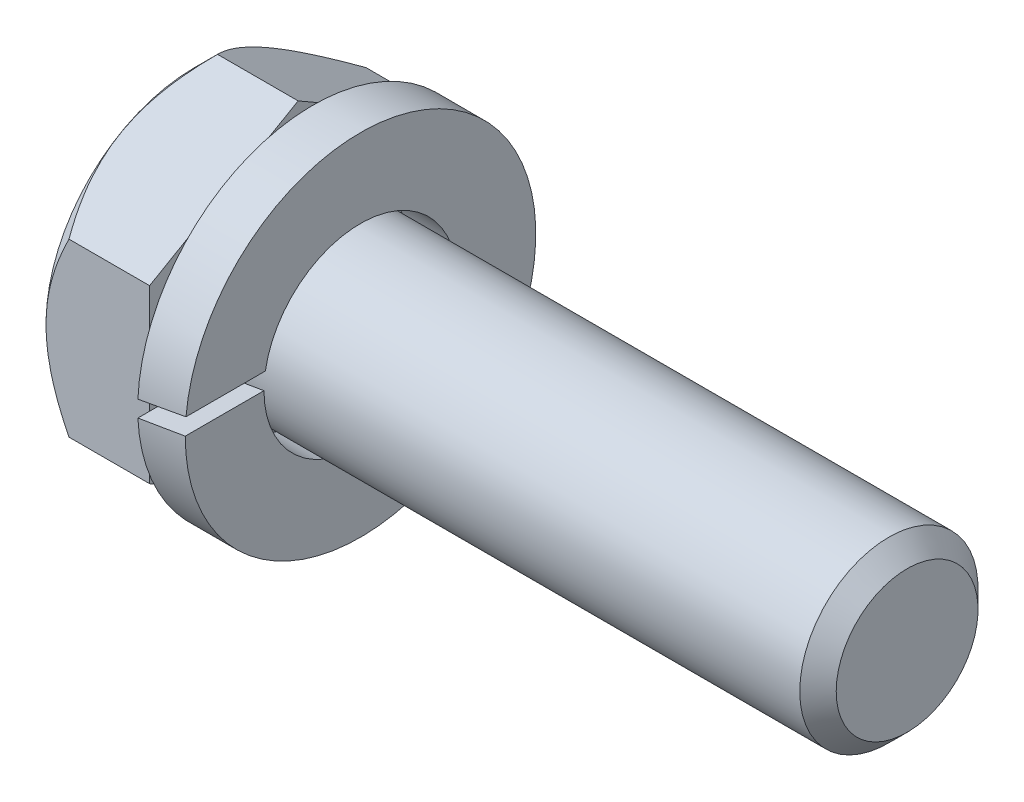
ISO-10303-21;
HEADER;
FILE_DESCRIPTION(('STEP AP214'),'2;1');
FILE_NAME('part.step','',(''),(''),'','','');
FILE_SCHEMA(('AUTOMOTIVE_DESIGN { 1 0 10303 214 1 1 1 1 }'));
ENDSEC;
DATA;
#1=APPLICATION_CONTEXT('core data for automotive mechanical design processes');
#2=APPLICATION_PROTOCOL_DEFINITION('international standard','automotive_design',2000,#1);
#3=PRODUCT_CONTEXT('',#1,'mechanical');
#4=PRODUCT('Part','Part','',(#3));
#5=PRODUCT_RELATED_PRODUCT_CATEGORY('part','',(#4));
#6=PRODUCT_DEFINITION_FORMATION('','',#4);
#7=PRODUCT_DEFINITION_CONTEXT('part definition',#1,'design');
#8=PRODUCT_DEFINITION('design','',#6,#7);
#9=PRODUCT_DEFINITION_SHAPE('','',#8);
#10=(LENGTH_UNIT() NAMED_UNIT(*) SI_UNIT(.MILLI.,.METRE.));
#11=(NAMED_UNIT(*) PLANE_ANGLE_UNIT() SI_UNIT($,.RADIAN.));
#12=(NAMED_UNIT(*) SI_UNIT($,.STERADIAN.) SOLID_ANGLE_UNIT());
#13=UNCERTAINTY_MEASURE_WITH_UNIT(LENGTH_MEASURE(1.E-05),#10,'distance_accuracy_value','');
#14=(GEOMETRIC_REPRESENTATION_CONTEXT(3) GLOBAL_UNCERTAINTY_ASSIGNED_CONTEXT((#13)) GLOBAL_UNIT_ASSIGNED_CONTEXT((#10,
#11,#12)) REPRESENTATION_CONTEXT('',''));
#15=CARTESIAN_POINT('',(0.,0.,0.));
#16=DIRECTION('',(0.,0.,1.));
#17=DIRECTION('',(1.,0.,0.));
#18=AXIS2_PLACEMENT_3D('',#15,#16,#17);
#19=CARTESIAN_POINT('',(0.,0.,0.));
#20=DIRECTION('',(1.,0.,0.));
#21=DIRECTION('',(0.,0.,-1.));
#22=AXIS2_PLACEMENT_3D('',#19,#20,#21);
#23=PLANE('',#22);
#24=CARTESIAN_POINT('',(0.,0.,0.));
#25=DIRECTION('',(1.,0.,0.));
#26=DIRECTION('',(0.,1.,0.));
#27=AXIS2_PLACEMENT_3D('',#24,#25,#26);
#28=CIRCLE('',#27,4.98782849064128);
#29=CARTESIAN_POINT('',(0.,4.98782849064128,0.));
#30=VERTEX_POINT('',#29);
#31=EDGE_CURVE('E93',#30,#30,#28,.T.);
#32=ORIENTED_EDGE('',*,*,#31,.F.);
#33=EDGE_LOOP('',(#32));
#34=FACE_BOUND('',#33,.T.);
#35=ADVANCED_FACE('F17',(#34),#23,.F.);
#36=CARTESIAN_POINT('',(0.790388246400653,0.,0.));
#37=DIRECTION('',(1.,0.,0.));
#38=DIRECTION('',(0.,1.,0.));
#39=AXIS2_PLACEMENT_3D('',#36,#37,#38);
#40=CONICAL_SURFACE('',#39,5.77821673704193,0.785398163397448);
#41=ORIENTED_EDGE('',*,*,#31,.T.);
#42=EDGE_LOOP('',(#41));
#43=FACE_BOUND('',#42,.T.);
#44=CARTESIAN_POINT('',(0.785674201271153,-5.77350269190118,-2.443489514586E-11));
#45=CARTESIAN_POINT('',(0.736048729817891,-5.72386977190017,0.0859667391553501));
#46=CARTESIAN_POINT('',(0.687946283924636,-5.67385536346438,0.172594235680909));
#47=CARTESIAN_POINT('',(0.595250703125351,-5.57298874154595,0.347300349634679));
#48=CARTESIAN_POINT('',(0.550659484629607,-5.52213608861416,0.435379728211159));
#49=CARTESIAN_POINT('',(0.422467391401462,-5.36773619419112,0.702808190033449));
#50=CARTESIAN_POINT('',(0.344994843842084,-5.2628819681038,0.884421037005834));
#51=CARTESIAN_POINT('',(0.212328879996502,-5.05143510511504,1.25065774680401));
#52=CARTESIAN_POINT('',(0.156801274711727,-4.94489649859185,1.43518802626953));
#53=CARTESIAN_POINT('',(0.0925698065095275,-4.78333727128345,1.71501681639916));
#54=CARTESIAN_POINT('',(0.0743445613691895,-4.72924636014758,1.8087050227142));
#55=CARTESIAN_POINT('',(0.0446597561360612,-4.62060660806497,1.99687459304298));
#56=CARTESIAN_POINT('',(0.0331991852174752,-4.56605783677109,2.09135583641444));
#57=CARTESIAN_POINT('',(0.0139833875195146,-4.4331252492637,2.32160183195882));
#58=CARTESIAN_POINT('',(0.00995211759112042,-4.35459819518237,2.4576146793964));
#59=CARTESIAN_POINT('',(0.0167221402267244,-4.19768567118316,2.72939514330691));
#60=CARTESIAN_POINT('',(0.027528631737059,-4.1193002605328,2.86516265712548));
#61=CARTESIAN_POINT('',(0.0633371757997653,-3.96326849991269,3.13541759411394));
#62=CARTESIAN_POINT('',(0.0883550996709724,-3.88562307510411,3.26990341485766));
#63=CARTESIAN_POINT('',(0.151226396311497,-3.73166678009449,3.53656353995939));
#64=CARTESIAN_POINT('',(0.189078784705768,-3.65535580801574,3.66873802077476));
#65=CARTESIAN_POINT('',(0.266947120415034,-3.51989944345856,3.90335532639636));
#66=CARTESIAN_POINT('',(0.304913990565411,-3.46045392818726,4.00631797912836));
#67=CARTESIAN_POINT('',(0.386965083990171,-3.34262984934184,4.21039527004364));
#68=CARTESIAN_POINT('',(0.431049491698554,-3.28425131799565,4.31150985240649));
#69=CARTESIAN_POINT('',(0.524347678410254,-3.16874509572953,4.51157249796175));
#70=CARTESIAN_POINT('',(0.5735453250176,-3.11161411994489,4.61052625070673));
#71=CARTESIAN_POINT('',(0.676424289361197,-2.99840990271166,4.80660170658575));
#72=CARTESIAN_POINT('',(0.730102859235246,-2.94233603849609,4.90372448838383));
#73=CARTESIAN_POINT('',(0.785674201267338,-2.88675134593577,5.0000000000214));
#74=B_SPLINE_CURVE_WITH_KNOTS('',3,(#44,#45,#46,#47,#48,#49,#50,#51,#52,#53,#54,#55,#56,#57,#58,
#59,#60,#61,#62,#63,#64,#65,#66,#67,#68,#69,#70,#71,#72,#73),.UNSPECIFIED.,.F.,.F.,(4,2,2,2,2,2,
2,2,2,2,2,2,2,2,4),(0.,0.332918274938574,0.66601701335916,1.33580998779217,1.99496891453922,
2.32390206369673,2.65278604886947,3.12337124426573,3.59412136828829,4.06539826228084,
4.53663901855104,4.91088168852215,5.28513564376501,5.65824273699947,6.03112268520356),.UNSPECIFIED.);
#75=CARTESIAN_POINT('',(0.785674201267662,-5.77350269190894,0.));
#76=VERTEX_POINT('',#75);
#77=CARTESIAN_POINT('',(0.785674201267662,-2.88675134595447,5.00000000001098));
#78=VERTEX_POINT('',#77);
#79=EDGE_CURVE('E71',#76,#78,#74,.T.);
#80=ORIENTED_EDGE('',*,*,#79,.T.);
#81=CARTESIAN_POINT('',(0.785674201271152,-2.88675134597175,4.99999999999204));
#82=CARTESIAN_POINT('',(0.736048729817889,-2.78748550596104,4.99999999999707));
#83=CARTESIAN_POINT('',(0.687946283924634,-2.68745668908576,4.9999999999992));
#84=CARTESIAN_POINT('',(0.59525070312535,-2.48572344524612,5.0000000000008));
#85=CARTESIAN_POINT('',(0.550659484629606,-2.38401813938345,5.00000000000028));
#86=CARTESIAN_POINT('',(0.422467391401462,-2.07521835053883,4.99999999999944));
#87=CARTESIAN_POINT('',(0.344994843842083,-1.86550989836347,4.99999999999985));
#88=CARTESIAN_POINT('',(0.212328879996501,-1.44261617238544,5.00000000000014));
#89=CARTESIAN_POINT('',(0.156801274711727,-1.22953895933927,5.00000000000003));
#90=CARTESIAN_POINT('',(0.0925698065095271,-0.906420504722544,4.99999999999999));
#91=CARTESIAN_POINT('',(0.0743445613691887,-0.79823868245078,5.));
#92=CARTESIAN_POINT('',(0.0446597561360605,-0.580959178285553,5.));
#93=CARTESIAN_POINT('',(0.0331991852174749,-0.471861635697782,5.));
#94=CARTESIAN_POINT('',(0.0139833875195144,-0.205996460683025,5.));
#95=CARTESIAN_POINT('',(0.00995211759111945,-0.0489423525203513,5.));
#96=CARTESIAN_POINT('',(0.0167221402267236,0.264882695478073,5.));
#97=CARTESIAN_POINT('',(0.0275286317370591,0.421653516778786,5.));
#98=CARTESIAN_POINT('',(0.0633371757997657,0.733717038019014,5.));
#99=CARTESIAN_POINT('',(0.0883550996709721,0.88900788763616,5.));
#100=CARTESIAN_POINT('',(0.151226396311496,1.19692047765541,5.));
#101=CARTESIAN_POINT('',(0.189078784705767,1.34954242181291,5.));
#102=CARTESIAN_POINT('',(0.266947120415033,1.62045515092726,5.));
#103=CARTESIAN_POINT('',(0.30491399056541,1.73934618146986,5.));
#104=CARTESIAN_POINT('',(0.38696508399017,1.97499433916071,5.));
#105=CARTESIAN_POINT('',(0.431049491698553,2.09175140185309,5.));
#106=CARTESIAN_POINT('',(0.524347678410253,2.32276384638533,5.));
#107=CARTESIAN_POINT('',(0.5735453250176,2.43702579795461,5.));
#108=CARTESIAN_POINT('',(0.676424289361197,2.66343423242106,5.));
#109=CARTESIAN_POINT('',(0.730102859235247,2.7755819608522,5.));
#110=CARTESIAN_POINT('',(0.785674201267337,2.88675134597284,5.));
#111=B_SPLINE_CURVE_WITH_KNOTS('',3,(#81,#82,#83,#84,#85,#86,#87,#88,#89,#90,#91,#92,#93,#94,
#95,#96,#97,#98,#99,#100,#101,#102,#103,#104,#105,#106,#107,#108,#109,#110),.UNSPECIFIED.,.F.,
.F.,(4,2,2,2,2,2,2,2,2,2,2,2,2,2,4),(0.,0.332918274938574,0.666017013359159,1.33580998779217,
1.99496891453922,2.32390206369673,2.65278604886946,3.12337124426573,3.59412136828829,
4.06539826228084,4.53663901855104,4.91088168852215,5.28513564376501,5.65824273699947,
6.03112268520356),.UNSPECIFIED.);
#112=CARTESIAN_POINT('',(0.785674201261322,2.88675134596081,5.));
#113=VERTEX_POINT('',#112);
#114=EDGE_CURVE('E74',#78,#113,#111,.T.);
#115=ORIENTED_EDGE('',*,*,#114,.T.);
#116=CARTESIAN_POINT('',(0.785674201271154,2.88675134592943,5.00000000001647));
#117=CARTESIAN_POINT('',(0.736048729817892,2.93638426593913,4.91403326084171));
#118=CARTESIAN_POINT('',(0.687946283924637,2.98639867437862,4.82740576431829));
#119=CARTESIAN_POINT('',(0.595250703125352,3.08726529629983,4.65269965036612));
#120=CARTESIAN_POINT('',(0.550659484629608,3.13811794923071,4.56462027178912));
#121=CARTESIAN_POINT('',(0.422467391401464,3.29251784365229,4.29719180996599));
#122=CARTESIAN_POINT('',(0.344994843842086,3.39737206974033,4.11557896299402));
#123=CARTESIAN_POINT('',(0.212328879996504,3.6088189327296,3.74934225319613));
#124=CARTESIAN_POINT('',(0.156801274711729,3.71535753925258,3.5648119737305));
#125=CARTESIAN_POINT('',(0.0925698065095297,3.87691676656091,3.28498318360083));
#126=CARTESIAN_POINT('',(0.0743445613691918,3.9310076776968,3.1912949772858));
#127=CARTESIAN_POINT('',(0.0446597561360633,4.03964742977942,3.00312540695703));
#128=CARTESIAN_POINT('',(0.033199185217477,4.0941962010733,2.90864416358556));
#129=CARTESIAN_POINT('',(0.013983387519516,4.22712878858068,2.67839816804118));
#130=CARTESIAN_POINT('',(0.00995211759112181,4.30565584266202,2.5423853206036));
#131=CARTESIAN_POINT('',(0.0167221402267265,4.46256836666123,2.27060485669309));
#132=CARTESIAN_POINT('',(0.0275286317370619,4.54095377731159,2.13483734287452));
#133=CARTESIAN_POINT('',(0.0633371757997677,4.6969855379317,1.86458240588606));
#134=CARTESIAN_POINT('',(0.0883550996709736,4.77463096274028,1.73009658514234));
#135=CARTESIAN_POINT('',(0.151226396311497,4.9285872577499,1.46343646004061));
#136=CARTESIAN_POINT('',(0.189078784705769,5.00489822982865,1.33126197922524));
#137=CARTESIAN_POINT('',(0.266947120415035,5.14035459438583,1.09664467360365));
#138=CARTESIAN_POINT('',(0.304913990565411,5.19980010965712,0.993682020871646));
#139=CARTESIAN_POINT('',(0.386965083990172,5.31762418850255,0.789604729956367));
#140=CARTESIAN_POINT('',(0.431049491698554,5.37600271984874,0.688490147593513));
#141=CARTESIAN_POINT('',(0.524347678410254,5.49150894211486,0.488427502038256));
#142=CARTESIAN_POINT('',(0.573545325017601,5.5486399178995,0.389473749293271));
#143=CARTESIAN_POINT('',(0.676424289361197,5.66184413513272,0.193398293414257));
#144=CARTESIAN_POINT('',(0.730102859235247,5.71791799934829,0.0962755116161708));
#145=CARTESIAN_POINT('',(0.785674201267338,5.77350269190862,-2.14011097428065E-11));
#146=B_SPLINE_CURVE_WITH_KNOTS('',3,(#116,#117,#118,#119,#120,#121,#122,#123,#124,#125,#126,
#127,#128,#129,#130,#131,#132,#133,#134,#135,#136,#137,#138,#139,#140,#141,#142,#143,#144,#145),
.UNSPECIFIED.,.F.,.F.,(4,2,2,2,2,2,2,2,2,2,2,2,2,2,4),(0.,0.332918274938573,0.666017013359158,
1.33580998779216,1.99496891453921,2.32390206369672,2.65278604886946,3.12337124426573,
3.59412136828829,4.06539826228083,4.53663901855103,4.91088168852215,5.28513564376501,
5.65824273699947,6.03112268520355),.UNSPECIFIED.);
#147=CARTESIAN_POINT('',(0.785674201267662,5.77350269190894,0.));
#148=VERTEX_POINT('',#147);
#149=EDGE_CURVE('E179',#113,#148,#146,.T.);
#150=ORIENTED_EDGE('',*,*,#149,.T.);
#151=CARTESIAN_POINT('',(0.785674201271152,5.77350269190117,2.44325864307196E-11));
#152=CARTESIAN_POINT('',(0.73604872981789,5.72386977190017,-0.0859667391553527));
#153=CARTESIAN_POINT('',(0.687946283924635,5.67385536346438,-0.172594235680911));
#154=CARTESIAN_POINT('',(0.59525070312535,5.57298874154595,-0.347300349634682));
#155=CARTESIAN_POINT('',(0.550659484629606,5.52213608861416,-0.435379728211161));
#156=CARTESIAN_POINT('',(0.422467391401461,5.36773619419112,-0.702808190033451));
#157=CARTESIAN_POINT('',(0.344994843842083,5.2628819681038,-0.884421037005836));
#158=CARTESIAN_POINT('',(0.212328879996502,5.05143510511504,-1.25065774680401));
#159=CARTESIAN_POINT('',(0.156801274711727,4.94489649859185,-1.43518802626953));
#160=CARTESIAN_POINT('',(0.0925698065095274,4.78333727128345,-1.71501681639916));
#161=CARTESIAN_POINT('',(0.074344561369189,4.72924636014758,-1.8087050227142));
#162=CARTESIAN_POINT('',(0.0446597561360606,4.62060660806497,-1.99687459304298));
#163=CARTESIAN_POINT('',(0.033199185217475,4.56605783677109,-2.09135583641444));
#164=CARTESIAN_POINT('',(0.0139833875195149,4.4331252492637,-2.32160183195882));
#165=CARTESIAN_POINT('',(0.00995211759112049,4.35459819518237,-2.4576146793964));
#166=CARTESIAN_POINT('',(0.0167221402267244,4.19768567118316,-2.72939514330691));
#167=CARTESIAN_POINT('',(0.0275286317370591,4.1193002605328,-2.86516265712548));
#168=CARTESIAN_POINT('',(0.0633371757997653,3.96326849991269,-3.13541759411394));
#169=CARTESIAN_POINT('',(0.0883550996709722,3.88562307510411,-3.26990341485766));
#170=CARTESIAN_POINT('',(0.151226396311497,3.73166678009449,-3.53656353995939));
#171=CARTESIAN_POINT('',(0.189078784705768,3.65535580801574,-3.66873802077476));
#172=CARTESIAN_POINT('',(0.266947120415034,3.51989944345856,-3.90335532639636));
#173=CARTESIAN_POINT('',(0.30491399056541,3.46045392818726,-4.00631797912836));
#174=CARTESIAN_POINT('',(0.38696508399017,3.34262984934184,-4.21039527004364));
#175=CARTESIAN_POINT('',(0.431049491698553,3.28425131799565,-4.31150985240649));
#176=CARTESIAN_POINT('',(0.524347678410254,3.16874509572953,-4.51157249796175));
#177=CARTESIAN_POINT('',(0.5735453250176,3.11161411994489,-4.61052625070673));
#178=CARTESIAN_POINT('',(0.676424289361198,2.99840990271166,-4.80660170658575));
#179=CARTESIAN_POINT('',(0.730102859235247,2.94233603849609,-4.90372448838383));
#180=CARTESIAN_POINT('',(0.785674201267338,2.88675134593577,-5.0000000000214));
#181=B_SPLINE_CURVE_WITH_KNOTS('',3,(#151,#152,#153,#154,#155,#156,#157,#158,#159,#160,#161,
#162,#163,#164,#165,#166,#167,#168,#169,#170,#171,#172,#173,#174,#175,#176,#177,#178,#179,#180),
.UNSPECIFIED.,.F.,.F.,(4,2,2,2,2,2,2,2,2,2,2,2,2,2,4),(0.,0.332918274938574,0.666017013359159,
1.33580998779217,1.99496891453922,2.32390206369673,2.65278604886946,3.12337124426573,
3.59412136828829,4.06539826228083,4.53663901855103,4.91088168852215,5.28513564376501,
5.65824273699947,6.03112268520356),.UNSPECIFIED.);
#182=CARTESIAN_POINT('',(0.785674201267662,2.88675134595447,-5.00000000001098));
#183=VERTEX_POINT('',#182);
#184=EDGE_CURVE('E186',#148,#183,#181,.T.);
#185=ORIENTED_EDGE('',*,*,#184,.T.);
#186=CARTESIAN_POINT('',(0.785674201271152,2.88675134597175,-4.99999999999204));
#187=CARTESIAN_POINT('',(0.736048729817889,2.78748550596104,-4.99999999999707));
#188=CARTESIAN_POINT('',(0.687946283924634,2.68745668908576,-4.9999999999992));
#189=CARTESIAN_POINT('',(0.595250703125349,2.48572344524612,-5.0000000000008));
#190=CARTESIAN_POINT('',(0.550659484629606,2.38401813938345,-5.00000000000028));
#191=CARTESIAN_POINT('',(0.422467391401462,2.07521835053883,-4.99999999999944));
#192=CARTESIAN_POINT('',(0.344994843842084,1.86550989836347,-4.99999999999985));
#193=CARTESIAN_POINT('',(0.212328879996502,1.44261617238544,-5.00000000000014));
#194=CARTESIAN_POINT('',(0.156801274711727,1.22953895933927,-5.00000000000003));
#195=CARTESIAN_POINT('',(0.092569806509527,0.906420504722544,-4.99999999999999));
#196=CARTESIAN_POINT('',(0.0743445613691887,0.79823868245078,-5.));
#197=CARTESIAN_POINT('',(0.0446597561360605,0.580959178285553,-5.));
#198=CARTESIAN_POINT('',(0.0331991852174749,0.471861635697781,-5.));
#199=CARTESIAN_POINT('',(0.0139833875195143,0.205996460683024,-5.));
#200=CARTESIAN_POINT('',(0.0099521175911194,0.0489423525203509,-5.));
#201=CARTESIAN_POINT('',(0.0167221402267236,-0.264882695478073,-5.));
#202=CARTESIAN_POINT('',(0.0275286317370591,-0.421653516778786,-5.));
#203=CARTESIAN_POINT('',(0.0633371757997658,-0.733717038019015,-5.));
#204=CARTESIAN_POINT('',(0.0883550996709721,-0.88900788763616,-5.));
#205=CARTESIAN_POINT('',(0.151226396311496,-1.19692047765541,-5.));
#206=CARTESIAN_POINT('',(0.189078784705767,-1.34954242181291,-5.));
#207=CARTESIAN_POINT('',(0.266947120415032,-1.62045515092726,-5.));
#208=CARTESIAN_POINT('',(0.304913990565409,-1.73934618146986,-5.));
#209=CARTESIAN_POINT('',(0.386965083990169,-1.97499433916071,-5.));
#210=CARTESIAN_POINT('',(0.431049491698552,-2.09175140185309,-5.));
#211=CARTESIAN_POINT('',(0.524347678410252,-2.32276384638532,-5.));
#212=CARTESIAN_POINT('',(0.573545325017599,-2.4370257979546,-5.));
#213=CARTESIAN_POINT('',(0.676424289361195,-2.66343423242106,-5.));
#214=CARTESIAN_POINT('',(0.730102859235245,-2.7755819608522,-5.));
#215=CARTESIAN_POINT('',(0.785674201267335,-2.88675134597284,-5.));
#216=B_SPLINE_CURVE_WITH_KNOTS('',3,(#186,#187,#188,#189,#190,#191,#192,#193,#194,#195,#196,
#197,#198,#199,#200,#201,#202,#203,#204,#205,#206,#207,#208,#209,#210,#211,#212,#213,#214,#215),
.UNSPECIFIED.,.F.,.F.,(4,2,2,2,2,2,2,2,2,2,2,2,2,2,4),(0.,0.332918274938574,0.666017013359159,
1.33580998779217,1.99496891453922,2.32390206369673,2.65278604886946,3.12337124426573,
3.59412136828829,4.06539826228084,4.53663901855104,4.91088168852215,5.28513564376501,
5.65824273699947,6.03112268520355),.UNSPECIFIED.);
#217=CARTESIAN_POINT('',(0.785674201267662,-2.88675134595447,-5.00000000001098));
#218=VERTEX_POINT('',#217);
#219=EDGE_CURVE('E211',#183,#218,#216,.T.);
#220=ORIENTED_EDGE('',*,*,#219,.T.);
#221=CARTESIAN_POINT('',(0.785674201271157,-2.88675134592943,-5.00000000001647));
#222=CARTESIAN_POINT('',(0.736048729817893,-2.93638426593913,-4.91403326084172));
#223=CARTESIAN_POINT('',(0.687946283924638,-2.98639867437862,-4.82740576431829));
#224=CARTESIAN_POINT('',(0.595250703125353,-3.08726529629983,-4.65269965036612));
#225=CARTESIAN_POINT('',(0.550659484629609,-3.13811794923071,-4.56462027178912));
#226=CARTESIAN_POINT('',(0.422467391401465,-3.29251784365229,-4.29719180996599));
#227=CARTESIAN_POINT('',(0.344994843842086,-3.39737206974033,-4.11557896299402));
#228=CARTESIAN_POINT('',(0.212328879996504,-3.6088189327296,-3.74934225319613));
#229=CARTESIAN_POINT('',(0.156801274711729,-3.71535753925259,-3.5648119737305));
#230=CARTESIAN_POINT('',(0.0925698065095292,-3.87691676656091,-3.28498318360083));
#231=CARTESIAN_POINT('',(0.0743445613691911,-3.9310076776968,-3.1912949772858));
#232=CARTESIAN_POINT('',(0.0446597561360628,-4.03964742977942,-3.00312540695702));
#233=CARTESIAN_POINT('',(0.033199185217477,-4.0941962010733,-2.90864416358556));
#234=CARTESIAN_POINT('',(0.0139833875195165,-4.22712878858068,-2.67839816804118));
#235=CARTESIAN_POINT('',(0.00995211759112203,-4.30565584266202,-2.5423853206036));
#236=CARTESIAN_POINT('',(0.0167221402267262,-4.46256836666123,-2.27060485669309));
#237=CARTESIAN_POINT('',(0.0275286317370612,-4.54095377731159,-2.13483734287452));
#238=CARTESIAN_POINT('',(0.0633371757997674,-4.6969855379317,-1.86458240588606));
#239=CARTESIAN_POINT('',(0.0883550996709739,-4.77463096274028,-1.73009658514234));
#240=CARTESIAN_POINT('',(0.151226396311498,-4.9285872577499,-1.46343646004061));
#241=CARTESIAN_POINT('',(0.18907878470577,-5.00489822982865,-1.33126197922524));
#242=CARTESIAN_POINT('',(0.266947120415035,-5.14035459438583,-1.09664467360364));
#243=CARTESIAN_POINT('',(0.304913990565411,-5.19980010965713,-0.993682020871644));
#244=CARTESIAN_POINT('',(0.386965083990172,-5.31762418850255,-0.789604729956365));
#245=CARTESIAN_POINT('',(0.431049491698555,-5.37600271984874,-0.688490147593512));
#246=CARTESIAN_POINT('',(0.524347678410255,-5.49150894211486,-0.488427502038256));
#247=CARTESIAN_POINT('',(0.573545325017601,-5.5486399178995,-0.389473749293271));
#248=CARTESIAN_POINT('',(0.676424289361197,-5.66184413513272,-0.193398293414258));
#249=CARTESIAN_POINT('',(0.730102859235247,-5.71791799934829,-0.0962755116161715));
#250=CARTESIAN_POINT('',(0.785674201267338,-5.77350269190862,2.13997418227646E-11));
#251=B_SPLINE_CURVE_WITH_KNOTS('',3,(#221,#222,#223,#224,#225,#226,#227,#228,#229,#230,#231,
#232,#233,#234,#235,#236,#237,#238,#239,#240,#241,#242,#243,#244,#245,#246,#247,#248,#249,#250),
.UNSPECIFIED.,.F.,.F.,(4,2,2,2,2,2,2,2,2,2,2,2,2,2,4),(0.,0.332918274938574,0.66601701335916,
1.33580998779217,1.99496891453922,2.32390206369673,2.65278604886946,3.12337124426573,
3.59412136828829,4.06539826228084,4.53663901855104,4.91088168852215,5.28513564376501,
5.65824273699947,6.03112268520356),.UNSPECIFIED.);
#252=EDGE_CURVE('E77',#218,#76,#251,.T.);
#253=ORIENTED_EDGE('',*,*,#252,.T.);
#254=EDGE_LOOP('',(#80,#115,#150,#185,#220,#253));
#255=FACE_BOUND('',#254,.T.);
#256=ADVANCED_FACE('F73',(#43,#255),#40,.T.);
#257=CARTESIAN_POINT('',(3.5,2.88675134594813,5.));
#258=DIRECTION('',(0.,0.,-1.));
#259=DIRECTION('',(-1.,0.,0.));
#260=AXIS2_PLACEMENT_3D('',#257,#258,#259);
#261=PLANE('',#260);
#262=ORIENTED_EDGE('',*,*,#114,.F.);
#263=DIRECTION('',(1.,0.,0.));
#264=VECTOR('',#263,1.);
#265=CARTESIAN_POINT('',(3.5,-2.88675134594813,5.));
#266=LINE('',#265,#264);
#267=CARTESIAN_POINT('',(3.5,-2.88675134594813,5.));
#268=VERTEX_POINT('',#267);
#269=EDGE_CURVE('E82',#78,#268,#266,.T.);
#270=ORIENTED_EDGE('',*,*,#269,.T.);
#271=DIRECTION('',(0.,1.,0.));
#272=VECTOR('',#271,1.);
#273=CARTESIAN_POINT('',(3.5,0.,5.));
#274=LINE('',#273,#272);
#275=CARTESIAN_POINT('',(3.5,2.88675134594813,5.));
#276=VERTEX_POINT('',#275);
#277=EDGE_CURVE('E120',#276,#268,#274,.F.);
#278=ORIENTED_EDGE('',*,*,#277,.F.);
#279=DIRECTION('',(1.,0.,0.));
#280=VECTOR('',#279,1.);
#281=CARTESIAN_POINT('',(3.5,2.88675134594813,5.));
#282=LINE('',#281,#280);
#283=EDGE_CURVE('E91',#276,#113,#282,.F.);
#284=ORIENTED_EDGE('',*,*,#283,.T.);
#285=EDGE_LOOP('',(#262,#270,#278,#284));
#286=FACE_BOUND('',#285,.T.);
#287=ADVANCED_FACE('F86',(#286),#261,.F.);
#288=CARTESIAN_POINT('',(3.5,-2.88675134594813,5.));
#289=DIRECTION('',(0.,0.866025403784439,-0.5));
#290=DIRECTION('',(0.,0.5,0.866025403784439));
#291=AXIS2_PLACEMENT_3D('',#288,#289,#290);
#292=PLANE('',#291);
#293=ORIENTED_EDGE('',*,*,#79,.F.);
#294=DIRECTION('',(1.,0.,0.));
#295=VECTOR('',#294,1.);
#296=CARTESIAN_POINT('',(3.5,-5.77350269189626,0.));
#297=LINE('',#296,#295);
#298=CARTESIAN_POINT('',(3.5,-5.77350269189626,0.));
#299=VERTEX_POINT('',#298);
#300=EDGE_CURVE('E100',#76,#299,#297,.T.);
#301=ORIENTED_EDGE('',*,*,#300,.T.);
#302=DIRECTION('',(0.,-0.5,-0.866025403784439));
#303=VECTOR('',#302,1.);
#304=CARTESIAN_POINT('',(3.5,-2.88675134594813,5.));
#305=LINE('',#304,#303);
#306=EDGE_CURVE('E97',#268,#299,#305,.T.);
#307=ORIENTED_EDGE('',*,*,#306,.F.);
#308=ORIENTED_EDGE('',*,*,#269,.F.);
#309=EDGE_LOOP('',(#293,#301,#307,#308));
#310=FACE_BOUND('',#309,.T.);
#311=ADVANCED_FACE('F95',(#310),#292,.F.);
#312=CARTESIAN_POINT('',(3.5,-5.77350269189626,0.));
#313=DIRECTION('',(0.,0.866025403784439,0.5));
#314=DIRECTION('',(0.,-0.5,0.866025403784439));
#315=AXIS2_PLACEMENT_3D('',#312,#313,#314);
#316=PLANE('',#315);
#317=ORIENTED_EDGE('',*,*,#252,.F.);
#318=DIRECTION('',(1.,0.,0.));
#319=VECTOR('',#318,1.);
#320=CARTESIAN_POINT('',(3.5,-2.88675134594812,-5.));
#321=LINE('',#320,#319);
#322=CARTESIAN_POINT('',(3.5,-2.88675134594812,-5.));
#323=VERTEX_POINT('',#322);
#324=EDGE_CURVE('E322',#218,#323,#321,.T.);
#325=ORIENTED_EDGE('',*,*,#324,.T.);
#326=DIRECTION('',(0.,0.5,-0.866025403784439));
#327=VECTOR('',#326,1.);
#328=CARTESIAN_POINT('',(3.5,-5.77350269189626,0.));
#329=LINE('',#328,#327);
#330=EDGE_CURVE('E127',#299,#323,#329,.T.);
#331=ORIENTED_EDGE('',*,*,#330,.F.);
#332=ORIENTED_EDGE('',*,*,#300,.F.);
#333=EDGE_LOOP('',(#317,#325,#331,#332));
#334=FACE_BOUND('',#333,.T.);
#335=ADVANCED_FACE('F226',(#334),#316,.F.);
#336=CARTESIAN_POINT('',(3.5,-2.88675134594813,-5.));
#337=DIRECTION('',(0.,0.,1.));
#338=DIRECTION('',(1.,0.,0.));
#339=AXIS2_PLACEMENT_3D('',#336,#337,#338);
#340=PLANE('',#339);
#341=ORIENTED_EDGE('',*,*,#219,.F.);
#342=DIRECTION('',(1.,0.,0.));
#343=VECTOR('',#342,1.);
#344=CARTESIAN_POINT('',(3.5,2.88675134594813,-5.));
#345=LINE('',#344,#343);
#346=CARTESIAN_POINT('',(3.5,2.88675134594813,-5.));
#347=VERTEX_POINT('',#346);
#348=EDGE_CURVE('E315',#183,#347,#345,.T.);
#349=ORIENTED_EDGE('',*,*,#348,.T.);
#350=DIRECTION('',(0.,1.,0.));
#351=VECTOR('',#350,1.);
#352=CARTESIAN_POINT('',(3.5,0.,-5.));
#353=LINE('',#352,#351);
#354=EDGE_CURVE('E117',#323,#347,#353,.T.);
#355=ORIENTED_EDGE('',*,*,#354,.F.);
#356=ORIENTED_EDGE('',*,*,#324,.F.);
#357=EDGE_LOOP('',(#341,#349,#355,#356));
#358=FACE_BOUND('',#357,.T.);
#359=ADVANCED_FACE('F229',(#358),#340,.F.);
#360=CARTESIAN_POINT('',(3.5,2.88675134594813,-5.));
#361=DIRECTION('',(0.,-0.866025403784439,0.5));
#362=DIRECTION('',(0.,-0.5,-0.866025403784439));
#363=AXIS2_PLACEMENT_3D('',#360,#361,#362);
#364=PLANE('',#363);
#365=ORIENTED_EDGE('',*,*,#184,.F.);
#366=DIRECTION('',(1.,0.,0.));
#367=VECTOR('',#366,1.);
#368=CARTESIAN_POINT('',(3.5,5.77350269189626,0.));
#369=LINE('',#368,#367);
#370=CARTESIAN_POINT('',(3.5,5.77350269189626,0.));
#371=VERTEX_POINT('',#370);
#372=EDGE_CURVE('E122',#148,#371,#369,.T.);
#373=ORIENTED_EDGE('',*,*,#372,.T.);
#374=DIRECTION('',(0.,0.5,0.866025403784439));
#375=VECTOR('',#374,1.);
#376=CARTESIAN_POINT('',(3.5,2.88675134594813,-5.));
#377=LINE('',#376,#375);
#378=EDGE_CURVE('E112',#347,#371,#377,.T.);
#379=ORIENTED_EDGE('',*,*,#378,.F.);
#380=ORIENTED_EDGE('',*,*,#348,.F.);
#381=EDGE_LOOP('',(#365,#373,#379,#380));
#382=FACE_BOUND('',#381,.T.);
#383=ADVANCED_FACE('F290',(#382),#364,.F.);
#384=CARTESIAN_POINT('',(3.5,5.77350269189626,0.));
#385=DIRECTION('',(0.,-0.866025403784439,-0.5));
#386=DIRECTION('',(0.,0.5,-0.866025403784439));
#387=AXIS2_PLACEMENT_3D('',#384,#385,#386);
#388=PLANE('',#387);
#389=ORIENTED_EDGE('',*,*,#149,.F.);
#390=ORIENTED_EDGE('',*,*,#283,.F.);
#391=DIRECTION('',(0.,-0.5,0.866025403784439));
#392=VECTOR('',#391,1.);
#393=CARTESIAN_POINT('',(3.5,5.77350269189626,0.));
#394=LINE('',#393,#392);
#395=EDGE_CURVE('E108',#371,#276,#394,.T.);
#396=ORIENTED_EDGE('',*,*,#395,.F.);
#397=ORIENTED_EDGE('',*,*,#372,.F.);
#398=EDGE_LOOP('',(#389,#390,#396,#397));
#399=FACE_BOUND('',#398,.T.);
#400=ADVANCED_FACE('F193',(#399),#388,.F.);
#401=CARTESIAN_POINT('',(3.5,0.,0.));
#402=DIRECTION('',(1.,0.,0.));
#403=DIRECTION('',(0.,0.,-1.));
#404=AXIS2_PLACEMENT_3D('',#401,#402,#403);
#405=PLANE('',#404);
#406=ORIENTED_EDGE('',*,*,#378,.T.);
#407=ORIENTED_EDGE('',*,*,#395,.T.);
#408=ORIENTED_EDGE('',*,*,#277,.T.);
#409=ORIENTED_EDGE('',*,*,#306,.T.);
#410=ORIENTED_EDGE('',*,*,#330,.T.);
#411=ORIENTED_EDGE('',*,*,#354,.T.);
#412=EDGE_LOOP('',(#406,#407,#408,#409,#410,#411));
#413=FACE_BOUND('',#412,.T.);
#414=CARTESIAN_POINT('',(3.49999999999994,0.,0.));
#415=DIRECTION('',(-1.,0.,0.));
#416=DIRECTION('',(0.,0.,1.));
#417=AXIS2_PLACEMENT_3D('',#414,#415,#416);
#418=CIRCLE('',#417,4.45);
#419=CARTESIAN_POINT('',(3.49999999999994,0.,4.45));
#420=VERTEX_POINT('',#419);
#421=EDGE_CURVE('E173',#420,#420,#418,.F.);
#422=ORIENTED_EDGE('',*,*,#421,.F.);
#423=EDGE_LOOP('',(#422));
#424=FACE_BOUND('',#423,.T.);
#425=ADVANCED_FACE('F283',(#413,#424),#405,.T.);
#426=CARTESIAN_POINT('',(4.,0.,0.));
#427=DIRECTION('',(-1.,0.,0.));
#428=DIRECTION('',(0.,0.,1.));
#429=AXIS2_PLACEMENT_3D('',#426,#427,#428);
#430=CYLINDRICAL_SURFACE('',#429,4.45);
#431=ORIENTED_EDGE('',*,*,#421,.T.);
#432=EDGE_LOOP('',(#431));
#433=FACE_BOUND('',#432,.T.);
#434=CARTESIAN_POINT('',(4.,0.,0.));
#435=DIRECTION('',(-1.,0.,0.));
#436=DIRECTION('',(0.,0.,1.));
#437=AXIS2_PLACEMENT_3D('',#434,#435,#436);
#438=CIRCLE('',#437,4.45);
#439=CARTESIAN_POINT('',(4.,-0.275000000000001,4.44149468084788));
#440=VERTEX_POINT('',#439);
#441=CARTESIAN_POINT('',(4.,0.275,4.44149468084788));
#442=VERTEX_POINT('',#441);
#443=EDGE_CURVE('E170',#440,#442,#438,.F.);
#444=ORIENTED_EDGE('',*,*,#443,.F.);
#445=CARTESIAN_POINT('',(4.,0.,0.));
#446=DIRECTION('',(-1.,0.,0.));
#447=DIRECTION('',(0.,0.,1.));
#448=AXIS2_PLACEMENT_3D('',#445,#446,#447);
#449=CIRCLE('',#448,4.45);
#450=EDGE_CURVE('E111',#440,#442,#449,.T.);
#451=ORIENTED_EDGE('',*,*,#450,.T.);
#452=EDGE_LOOP('',(#444,#451));
#453=FACE_BOUND('',#452,.T.);
#454=ADVANCED_FACE('F280',(#433,#453),#430,.T.);
#455=CARTESIAN_POINT('',(4.,5.90000000000003,0.));
#456=DIRECTION('',(-1.,0.,0.));
#457=DIRECTION('',(0.,0.,1.));
#458=AXIS2_PLACEMENT_3D('',#455,#456,#457);
#459=PLANE('',#458);
#460=ORIENTED_EDGE('',*,*,#443,.T.);
#461=DIRECTION('',(0.,0.,1.));
#462=VECTOR('',#461,1.);
#463=CARTESIAN_POINT('',(4.,0.275,0.));
#464=LINE('',#463,#462);
#465=CARTESIAN_POINT('',(4.,0.275,5.89358761706314));
#466=VERTEX_POINT('',#465);
#467=EDGE_CURVE('E169',#442,#466,#464,.T.);
#468=ORIENTED_EDGE('',*,*,#467,.T.);
#469=CARTESIAN_POINT('',(4.,0.,0.));
#470=DIRECTION('',(-1.,0.,0.));
#471=DIRECTION('',(0.,0.,1.));
#472=AXIS2_PLACEMENT_3D('',#469,#470,#471);
#473=CIRCLE('',#472,5.9);
#474=CARTESIAN_POINT('',(4.,-0.275,5.89358761706314));
#475=VERTEX_POINT('',#474);
#476=EDGE_CURVE('E160',#475,#466,#473,.F.);
#477=ORIENTED_EDGE('',*,*,#476,.F.);
#478=DIRECTION('',(0.,0.,1.));
#479=VECTOR('',#478,1.);
#480=CARTESIAN_POINT('',(4.,-0.275,9.55));
#481=LINE('',#480,#479);
#482=EDGE_CURVE('E166',#440,#475,#481,.T.);
#483=ORIENTED_EDGE('',*,*,#482,.F.);
#484=EDGE_LOOP('',(#460,#468,#477,#483));
#485=FACE_BOUND('',#484,.T.);
#486=ADVANCED_FACE('F276',(#485),#459,.T.);
#487=CARTESIAN_POINT('',(4.,-0.275,9.55));
#488=DIRECTION('',(-0.169391215599333,0.985548890759753,0.));
#489=DIRECTION('',(-0.985548890759753,-0.169391215599333,0.));
#490=AXIS2_PLACEMENT_3D('',#487,#488,#489);
#491=PLANE('',#490);
#492=ORIENTED_EDGE('',*,*,#482,.T.);
#493=CARTESIAN_POINT('',(5.6,0.,0.));
#494=DIRECTION('',(-0.169391215599333,0.985548890759753,0.));
#495=DIRECTION('',(-0.985548890759753,-0.169391215599333,0.));
#496=AXIS2_PLACEMENT_3D('',#493,#494,#495);
#497=ELLIPSE('',#496,34.8306137312071,5.9);
#498=CARTESIAN_POINT('',(5.6,0.,5.9));
#499=VERTEX_POINT('',#498);
#500=EDGE_CURVE('E163',#499,#475,#497,.F.);
#501=ORIENTED_EDGE('',*,*,#500,.F.);
#502=DIRECTION('',(0.,0.,-1.));
#503=VECTOR('',#502,1.);
#504=CARTESIAN_POINT('',(5.6,0.,0.));
#505=LINE('',#504,#503);
#506=CARTESIAN_POINT('',(5.6,0.,3.25));
#507=VERTEX_POINT('',#506);
#508=EDGE_CURVE('E153',#507,#499,#505,.F.);
#509=ORIENTED_EDGE('',*,*,#508,.F.);
#510=CARTESIAN_POINT('',(5.6,0.,0.));
#511=DIRECTION('',(-0.169391215599333,0.985548890759753,0.));
#512=DIRECTION('',(-0.985548890759753,-0.169391215599333,0.));
#513=AXIS2_PLACEMENT_3D('',#510,#511,#512);
#514=ELLIPSE('',#513,19.1863550214277,3.25);
#515=CARTESIAN_POINT('',(4.,-0.275,3.23834448445498));
#516=VERTEX_POINT('',#515);
#517=EDGE_CURVE('E35',#507,#516,#514,.F.);
#518=ORIENTED_EDGE('',*,*,#517,.T.);
#519=DIRECTION('',(0.,0.,1.));
#520=VECTOR('',#519,1.);
#521=CARTESIAN_POINT('',(4.,-0.275,9.55));
#522=LINE('',#521,#520);
#523=EDGE_CURVE('E168',#516,#440,#522,.T.);
#524=ORIENTED_EDGE('',*,*,#523,.T.);
#525=EDGE_LOOP('',(#492,#501,#509,#518,#524));
#526=FACE_BOUND('',#525,.T.);
#527=ADVANCED_FACE('F272',(#526),#491,.T.);
#528=CARTESIAN_POINT('',(50.,0.,0.));
#529=DIRECTION('',(-1.,0.,0.));
#530=DIRECTION('',(0.,0.,1.));
#531=AXIS2_PLACEMENT_3D('',#528,#529,#530);
#532=CYLINDRICAL_SURFACE('',#531,5.9);
#533=ORIENTED_EDGE('',*,*,#476,.T.);
#534=CARTESIAN_POINT('',(2.39999999999999,0.,0.));
#535=DIRECTION('',(0.169391215599331,-0.985548890759754,0.));
#536=DIRECTION('',(-0.985548890759754,-0.169391215599331,0.));
#537=AXIS2_PLACEMENT_3D('',#534,#535,#536);
#538=ELLIPSE('',#537,34.8306137312076,5.9);
#539=CARTESIAN_POINT('',(5.6,0.549999999999997,5.87430846993925));
#540=VERTEX_POINT('',#539);
#541=EDGE_CURVE('E154',#540,#466,#538,.T.);
#542=ORIENTED_EDGE('',*,*,#541,.F.);
#543=CARTESIAN_POINT('',(5.6,0.,0.));
#544=DIRECTION('',(-1.,0.,0.));
#545=DIRECTION('',(0.,0.,1.));
#546=AXIS2_PLACEMENT_3D('',#543,#544,#545);
#547=CIRCLE('',#546,5.9);
#548=EDGE_CURVE('E150',#499,#540,#547,.F.);
#549=ORIENTED_EDGE('',*,*,#548,.F.);
#550=ORIENTED_EDGE('',*,*,#500,.T.);
#551=EDGE_LOOP('',(#533,#542,#549,#550));
#552=FACE_BOUND('',#551,.T.);
#553=ADVANCED_FACE('F268',(#552),#532,.T.);
#554=CARTESIAN_POINT('',(5.6,0.549999999999997,9.55));
#555=DIRECTION('',(0.169391215599331,-0.985548890759754,0.));
#556=DIRECTION('',(0.985548890759754,0.169391215599331,0.));
#557=AXIS2_PLACEMENT_3D('',#554,#555,#556);
#558=PLANE('',#557);
#559=DIRECTION('',(0.,0.,-1.));
#560=VECTOR('',#559,1.);
#561=CARTESIAN_POINT('',(5.6,0.549999999999997,0.));
#562=LINE('',#561,#560);
#563=CARTESIAN_POINT('',(5.6,0.549999999999997,3.20312347560939));
#564=VERTEX_POINT('',#563);
#565=EDGE_CURVE('E149',#540,#564,#562,.T.);
#566=ORIENTED_EDGE('',*,*,#565,.F.);
#567=ORIENTED_EDGE('',*,*,#541,.T.);
#568=ORIENTED_EDGE('',*,*,#467,.F.);
#569=DIRECTION('',(0.,0.,1.));
#570=VECTOR('',#569,1.);
#571=CARTESIAN_POINT('',(4.,0.275,9.55));
#572=LINE('',#571,#570);
#573=CARTESIAN_POINT('',(4.,0.275,3.23834448445498));
#574=VERTEX_POINT('',#573);
#575=EDGE_CURVE('E159',#442,#574,#572,.F.);
#576=ORIENTED_EDGE('',*,*,#575,.T.);
#577=CARTESIAN_POINT('',(2.39999999999999,0.,0.));
#578=DIRECTION('',(0.169391215599331,-0.985548890759754,0.));
#579=DIRECTION('',(-0.985548890759754,-0.169391215599331,0.));
#580=AXIS2_PLACEMENT_3D('',#577,#578,#579);
#581=ELLIPSE('',#580,19.1863550214279,3.25);
#582=EDGE_CURVE('E157',#574,#564,#581,.F.);
#583=ORIENTED_EDGE('',*,*,#582,.T.);
#584=EDGE_LOOP('',(#566,#567,#568,#576,#583));
#585=FACE_BOUND('',#584,.T.);
#586=ADVANCED_FACE('F264',(#585),#558,.T.);
#587=CARTESIAN_POINT('',(5.6,3.25000000000006,0.));
#588=DIRECTION('',(1.,0.,0.));
#589=DIRECTION('',(0.,0.,-1.));
#590=AXIS2_PLACEMENT_3D('',#587,#588,#589);
#591=PLANE('',#590);
#592=ORIENTED_EDGE('',*,*,#548,.T.);
#593=ORIENTED_EDGE('',*,*,#565,.T.);
#594=CARTESIAN_POINT('',(5.6,0.,0.));
#595=DIRECTION('',(-1.,0.,0.));
#596=DIRECTION('',(0.,0.,1.));
#597=AXIS2_PLACEMENT_3D('',#594,#595,#596);
#598=CIRCLE('',#597,3.25);
#599=EDGE_CURVE('E144',#564,#507,#598,.T.);
#600=ORIENTED_EDGE('',*,*,#599,.T.);
#601=ORIENTED_EDGE('',*,*,#508,.T.);
#602=EDGE_LOOP('',(#592,#593,#600,#601));
#603=FACE_BOUND('',#602,.T.);
#604=ADVANCED_FACE('F260',(#603),#591,.T.);
#605=CARTESIAN_POINT('',(24.,2.3865,0.));
#606=DIRECTION('',(-1.,0.,0.));
#607=DIRECTION('',(0.,0.,1.));
#608=AXIS2_PLACEMENT_3D('',#605,#606,#607);
#609=PLANE('',#608);
#610=CARTESIAN_POINT('',(23.9999999999441,0.,0.));
#611=DIRECTION('',(-1.,0.,0.));
#612=DIRECTION('',(0.,0.,1.));
#613=AXIS2_PLACEMENT_3D('',#610,#611,#612);
#614=CIRCLE('',#613,2.38650000000007);
#615=CARTESIAN_POINT('',(23.9999999999441,0.,2.38650000000007));
#616=VERTEX_POINT('',#615);
#617=EDGE_CURVE('E141',#616,#616,#614,.T.);
#618=ORIENTED_EDGE('',*,*,#617,.F.);
#619=EDGE_LOOP('',(#618));
#620=FACE_BOUND('',#619,.T.);
#621=ADVANCED_FACE('F257',(#620),#609,.F.);
#622=CARTESIAN_POINT('',(50.,0.,0.));
#623=DIRECTION('',(-1.,0.,0.));
#624=DIRECTION('',(0.,0.,1.));
#625=AXIS2_PLACEMENT_3D('',#622,#623,#624);
#626=CYLINDRICAL_SURFACE('',#625,3.25);
#627=ORIENTED_EDGE('',*,*,#517,.F.);
#628=ORIENTED_EDGE('',*,*,#599,.F.);
#629=ORIENTED_EDGE('',*,*,#582,.F.);
#630=CARTESIAN_POINT('',(4.,0.,0.));
#631=DIRECTION('',(-1.,0.,0.));
#632=DIRECTION('',(0.,0.,1.));
#633=AXIS2_PLACEMENT_3D('',#630,#631,#632);
#634=CIRCLE('',#633,3.25);
#635=EDGE_CURVE('E139',#574,#516,#634,.T.);
#636=ORIENTED_EDGE('',*,*,#635,.T.);
#637=EDGE_LOOP('',(#627,#628,#629,#636));
#638=FACE_BOUND('',#637,.T.);
#639=ADVANCED_FACE('F253',(#638),#626,.F.);
#640=CARTESIAN_POINT('',(23.3864999999582,0.,0.));
#641=DIRECTION('',(-1.,0.,0.));
#642=DIRECTION('',(0.,0.,1.));
#643=AXIS2_PLACEMENT_3D('',#640,#641,#642);
#644=CONICAL_SURFACE('',#643,2.9999999999859,0.785398163397448);
#645=CARTESIAN_POINT('',(23.3865,0.,0.));
#646=DIRECTION('',(-1.,0.,0.));
#647=DIRECTION('',(0.,0.,1.));
#648=AXIS2_PLACEMENT_3D('',#645,#646,#647);
#649=CIRCLE('',#648,3.);
#650=CARTESIAN_POINT('',(23.3865,0.,3.));
#651=VERTEX_POINT('',#650);
#652=EDGE_CURVE('E26',#651,#651,#649,.T.);
#653=ORIENTED_EDGE('',*,*,#652,.F.);
#654=EDGE_LOOP('',(#653));
#655=FACE_BOUND('',#654,.T.);
#656=ORIENTED_EDGE('',*,*,#617,.T.);
#657=EDGE_LOOP('',(#656));
#658=FACE_BOUND('',#657,.T.);
#659=ADVANCED_FACE('F246',(#655,#658),#644,.T.);
#660=CARTESIAN_POINT('',(4.,4.45,0.));
#661=DIRECTION('',(-1.,0.,0.));
#662=DIRECTION('',(0.,0.,1.));
#663=AXIS2_PLACEMENT_3D('',#660,#661,#662);
#664=PLANE('',#663);
#665=ORIENTED_EDGE('',*,*,#575,.F.);
#666=ORIENTED_EDGE('',*,*,#450,.F.);
#667=ORIENTED_EDGE('',*,*,#523,.F.);
#668=ORIENTED_EDGE('',*,*,#635,.F.);
#669=EDGE_LOOP('',(#665,#666,#667,#668));
#670=FACE_BOUND('',#669,.T.);
#671=CARTESIAN_POINT('',(4.,0.,0.));
#672=DIRECTION('',(-1.,0.,0.));
#673=DIRECTION('',(0.,0.,1.));
#674=AXIS2_PLACEMENT_3D('',#671,#672,#673);
#675=CIRCLE('',#674,3.);
#676=CARTESIAN_POINT('',(4.,0.,3.));
#677=VERTEX_POINT('',#676);
#678=EDGE_CURVE('E11',#677,#677,#675,.F.);
#679=ORIENTED_EDGE('',*,*,#678,.F.);
#680=EDGE_LOOP('',(#679));
#681=FACE_BOUND('',#680,.T.);
#682=ADVANCED_FACE('F240',(#670,#681),#664,.F.);
#683=CARTESIAN_POINT('',(24.,0.,0.));
#684=DIRECTION('',(-1.,0.,0.));
#685=DIRECTION('',(0.,0.,1.));
#686=AXIS2_PLACEMENT_3D('',#683,#684,#685);
#687=CYLINDRICAL_SURFACE('',#686,3.);
#688=ORIENTED_EDGE('',*,*,#678,.T.);
#689=EDGE_LOOP('',(#688));
#690=FACE_BOUND('',#689,.T.);
#691=ORIENTED_EDGE('',*,*,#652,.T.);
#692=EDGE_LOOP('',(#691));
#693=FACE_BOUND('',#692,.T.);
#694=ADVANCED_FACE('F238',(#690,#693),#687,.T.);
#695=CLOSED_SHELL('',(#35,#256,#287,#311,#335,#359,#383,#400,#425,#454,#486,#527,#553,#586,#604,
#621,#639,#659,#682,#694));
#696=MANIFOLD_SOLID_BREP('B1',#695);
#697=ADVANCED_BREP_SHAPE_REPRESENTATION('',(#18,#696),#14);
#698=SHAPE_DEFINITION_REPRESENTATION(#9,#697);
ENDSEC;
END-ISO-10303-21;
